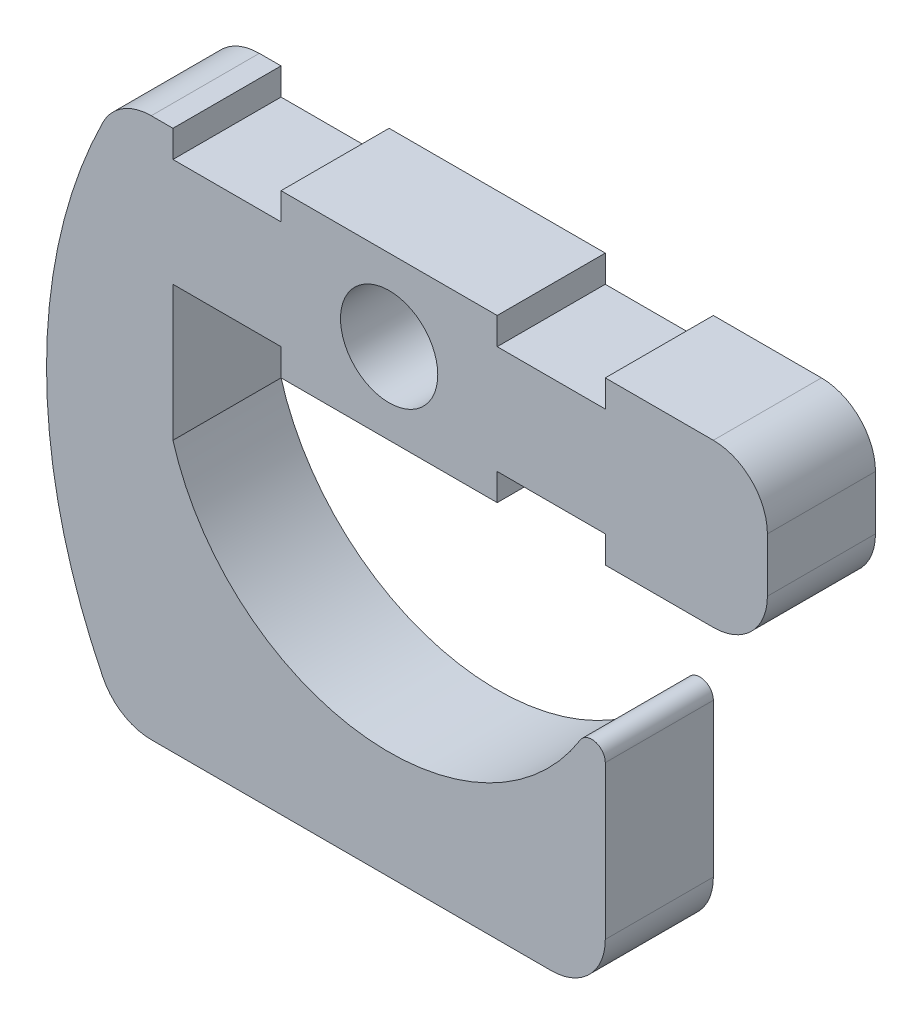
ISO-10303-21;
HEADER;
FILE_DESCRIPTION(('STEP AP214'),'2;1');
FILE_NAME('part.step','',(''),(''),'','','');
FILE_SCHEMA(('AUTOMOTIVE_DESIGN { 1 0 10303 214 1 1 1 1 }'));
ENDSEC;
DATA;
#1=APPLICATION_CONTEXT('core data for automotive mechanical design processes');
#2=APPLICATION_PROTOCOL_DEFINITION('international standard','automotive_design',2000,#1);
#3=PRODUCT_CONTEXT('',#1,'mechanical');
#4=PRODUCT('Part','Part','',(#3));
#5=PRODUCT_RELATED_PRODUCT_CATEGORY('part','',(#4));
#6=PRODUCT_DEFINITION_FORMATION('','',#4);
#7=PRODUCT_DEFINITION_CONTEXT('part definition',#1,'design');
#8=PRODUCT_DEFINITION('design','',#6,#7);
#9=PRODUCT_DEFINITION_SHAPE('','',#8);
#10=(LENGTH_UNIT() NAMED_UNIT(*) SI_UNIT(.MILLI.,.METRE.));
#11=(NAMED_UNIT(*) PLANE_ANGLE_UNIT() SI_UNIT($,.RADIAN.));
#12=(NAMED_UNIT(*) SI_UNIT($,.STERADIAN.) SOLID_ANGLE_UNIT());
#13=UNCERTAINTY_MEASURE_WITH_UNIT(LENGTH_MEASURE(1.E-05),#10,'distance_accuracy_value','');
#14=(GEOMETRIC_REPRESENTATION_CONTEXT(3) GLOBAL_UNCERTAINTY_ASSIGNED_CONTEXT((#13)) GLOBAL_UNIT_ASSIGNED_CONTEXT((#10,
#11,#12)) REPRESENTATION_CONTEXT('',''));
#15=CARTESIAN_POINT('',(0.,0.,0.));
#16=DIRECTION('',(0.,0.,1.));
#17=DIRECTION('',(1.,0.,0.));
#18=AXIS2_PLACEMENT_3D('',#15,#16,#17);
#19=CARTESIAN_POINT('',(0.,-3.81,2.54));
#20=DIRECTION('',(0.,1.,0.));
#21=DIRECTION('',(0.,0.,1.));
#22=AXIS2_PLACEMENT_3D('',#19,#20,#21);
#23=PLANE('',#22);
#24=DIRECTION('',(0.,0.,1.));
#25=VECTOR('',#24,1.);
#26=CARTESIAN_POINT('',(5.08,-3.81,-2.54));
#27=LINE('',#26,#25);
#28=CARTESIAN_POINT('',(5.08,-3.81,-2.54));
#29=VERTEX_POINT('',#28);
#30=CARTESIAN_POINT('',(5.08,-3.81,2.54));
#31=VERTEX_POINT('',#30);
#32=EDGE_CURVE('E605',#29,#31,#27,.T.);
#33=ORIENTED_EDGE('',*,*,#32,.T.);
#34=DIRECTION('',(1.,0.,0.));
#35=VECTOR('',#34,1.);
#36=CARTESIAN_POINT('',(0.,-3.81,2.54));
#37=LINE('',#36,#35);
#38=CARTESIAN_POINT('',(-5.08,-3.81,2.54));
#39=VERTEX_POINT('',#38);
#40=EDGE_CURVE('E284',#39,#31,#37,.T.);
#41=ORIENTED_EDGE('',*,*,#40,.F.);
#42=DIRECTION('',(0.,0.,-1.));
#43=VECTOR('',#42,1.);
#44=CARTESIAN_POINT('',(-5.08,-3.81,2.54));
#45=LINE('',#44,#43);
#46=CARTESIAN_POINT('',(-5.08,-3.81,-2.54));
#47=VERTEX_POINT('',#46);
#48=EDGE_CURVE('E377',#39,#47,#45,.T.);
#49=ORIENTED_EDGE('',*,*,#48,.T.);
#50=DIRECTION('',(1.,0.,0.));
#51=VECTOR('',#50,1.);
#52=CARTESIAN_POINT('',(0.,-3.81,-2.54));
#53=LINE('',#52,#51);
#54=EDGE_CURVE('E309',#47,#29,#53,.T.);
#55=ORIENTED_EDGE('',*,*,#54,.T.);
#56=EDGE_LOOP('',(#33,#41,#49,#55));
#57=FACE_BOUND('',#56,.T.);
#58=ADVANCED_FACE('F68',(#57),#23,.F.);
#59=CARTESIAN_POINT('',(0.,3.81,2.54));
#60=DIRECTION('',(0.,1.,0.));
#61=DIRECTION('',(0.,0.,1.));
#62=AXIS2_PLACEMENT_3D('',#59,#60,#61);
#63=PLANE('',#62);
#64=DIRECTION('',(1.,0.,0.));
#65=VECTOR('',#64,1.);
#66=CARTESIAN_POINT('',(0.,3.81,-2.54));
#67=LINE('',#66,#65);
#68=CARTESIAN_POINT('',(10.16,3.81,-2.54));
#69=VERTEX_POINT('',#68);
#70=CARTESIAN_POINT('',(15.24,3.81,-2.54));
#71=VERTEX_POINT('',#70);
#72=EDGE_CURVE('E270',#69,#71,#67,.T.);
#73=ORIENTED_EDGE('',*,*,#72,.F.);
#74=DIRECTION('',(0.,0.,1.));
#75=VECTOR('',#74,1.);
#76=CARTESIAN_POINT('',(10.16,3.81,-2.54));
#77=LINE('',#76,#75);
#78=CARTESIAN_POINT('',(10.16,3.81,2.54));
#79=VERTEX_POINT('',#78);
#80=EDGE_CURVE('E253',#69,#79,#77,.T.);
#81=ORIENTED_EDGE('',*,*,#80,.T.);
#82=DIRECTION('',(1.,0.,0.));
#83=VECTOR('',#82,1.);
#84=CARTESIAN_POINT('',(0.,3.81,2.54));
#85=LINE('',#84,#83);
#86=CARTESIAN_POINT('',(15.24,3.81,2.54));
#87=VERTEX_POINT('',#86);
#88=EDGE_CURVE('E268',#79,#87,#85,.T.);
#89=ORIENTED_EDGE('',*,*,#88,.T.);
#90=DIRECTION('',(0.,0.,-1.));
#91=VECTOR('',#90,1.);
#92=CARTESIAN_POINT('',(15.24,3.81,-2.54));
#93=LINE('',#92,#91);
#94=EDGE_CURVE('E365',#87,#71,#93,.T.);
#95=ORIENTED_EDGE('',*,*,#94,.T.);
#96=EDGE_LOOP('',(#73,#81,#89,#95));
#97=FACE_BOUND('',#96,.T.);
#98=ADVANCED_FACE('F266',(#97),#63,.T.);
#99=DIRECTION('',(0.,0.,1.));
#100=VECTOR('',#99,1.);
#101=CARTESIAN_POINT('',(5.08,3.81,-2.54));
#102=LINE('',#101,#100);
#103=CARTESIAN_POINT('',(5.08,3.81,-2.54));
#104=VERTEX_POINT('',#103);
#105=CARTESIAN_POINT('',(5.08,3.81,2.54));
#106=VERTEX_POINT('',#105);
#107=EDGE_CURVE('E578',#104,#106,#102,.T.);
#108=ORIENTED_EDGE('',*,*,#107,.F.);
#109=CARTESIAN_POINT('',(-5.08,3.81,-2.54));
#110=VERTEX_POINT('',#109);
#111=EDGE_CURVE('E319',#110,#104,#67,.T.);
#112=ORIENTED_EDGE('',*,*,#111,.F.);
#113=DIRECTION('',(0.,0.,1.));
#114=VECTOR('',#113,1.);
#115=CARTESIAN_POINT('',(-5.08,3.81,-2.54));
#116=LINE('',#115,#114);
#117=CARTESIAN_POINT('',(-5.08,3.81,2.54));
#118=VERTEX_POINT('',#117);
#119=EDGE_CURVE('E306',#110,#118,#116,.T.);
#120=ORIENTED_EDGE('',*,*,#119,.T.);
#121=EDGE_CURVE('E279',#118,#106,#85,.T.);
#122=ORIENTED_EDGE('',*,*,#121,.T.);
#123=EDGE_LOOP('',(#108,#112,#120,#122));
#124=FACE_BOUND('',#123,.T.);
#125=ADVANCED_FACE('F481',(#124),#63,.T.);
#126=CARTESIAN_POINT('',(0.,0.,2.54));
#127=DIRECTION('',(0.,0.,1.));
#128=DIRECTION('',(1.,0.,0.));
#129=AXIS2_PLACEMENT_3D('',#126,#127,#128);
#130=PLANE('',#129);
#131=DIRECTION('',(0.,-1.,0.));
#132=VECTOR('',#131,1.);
#133=CARTESIAN_POINT('',(10.16,0.,2.54));
#134=LINE('',#133,#132);
#135=CARTESIAN_POINT('',(10.16,-11.8533333333333,2.54));
#136=VERTEX_POINT('',#135);
#137=CARTESIAN_POINT('',(10.16,-19.05,2.54));
#138=VERTEX_POINT('',#137);
#139=EDGE_CURVE('E328',#136,#138,#134,.T.);
#140=ORIENTED_EDGE('',*,*,#139,.F.);
#141=CARTESIAN_POINT('',(9.525,-11.8533333333333,2.54));
#142=DIRECTION('',(0.,0.,1.));
#143=DIRECTION('',(1.,0.,0.));
#144=AXIS2_PLACEMENT_3D('',#141,#142,#143);
#145=CIRCLE('',#144,0.635);
#146=CARTESIAN_POINT('',(8.98584905660377,-11.5178616352201,2.54));
#147=VERTEX_POINT('',#146);
#148=EDGE_CURVE('E12',#136,#147,#145,.T.);
#149=ORIENTED_EDGE('',*,*,#148,.T.);
#150=CARTESIAN_POINT('',(0.,-5.92666666666666,2.54));
#151=DIRECTION('',(0.,0.,1.));
#152=DIRECTION('',(1.,0.,0.));
#153=AXIS2_PLACEMENT_3D('',#150,#151,#152);
#154=CIRCLE('',#153,10.5833333333333);
#155=CARTESIAN_POINT('',(-10.16,-8.89,2.54));
#156=VERTEX_POINT('',#155);
#157=EDGE_CURVE('E388',#147,#156,#154,.F.);
#158=ORIENTED_EDGE('',*,*,#157,.T.);
#159=DIRECTION('',(0.,1.,0.));
#160=VECTOR('',#159,1.);
#161=CARTESIAN_POINT('',(-10.16,0.,2.54));
#162=LINE('',#161,#160);
#163=CARTESIAN_POINT('',(-10.16,-2.54,2.54));
#164=VERTEX_POINT('',#163);
#165=EDGE_CURVE('E611',#156,#164,#162,.T.);
#166=ORIENTED_EDGE('',*,*,#165,.T.);
#167=DIRECTION('',(-1.,0.,0.));
#168=VECTOR('',#167,1.);
#169=CARTESIAN_POINT('',(0.,-2.54,2.54));
#170=LINE('',#169,#168);
#171=CARTESIAN_POINT('',(-5.08,-2.54,2.54));
#172=VERTEX_POINT('',#171);
#173=EDGE_CURVE('E400',#172,#164,#170,.T.);
#174=ORIENTED_EDGE('',*,*,#173,.F.);
#175=DIRECTION('',(0.,1.,0.));
#176=VECTOR('',#175,1.);
#177=CARTESIAN_POINT('',(-5.08,0.,2.54));
#178=LINE('',#177,#176);
#179=EDGE_CURVE('E404',#39,#172,#178,.T.);
#180=ORIENTED_EDGE('',*,*,#179,.F.);
#181=ORIENTED_EDGE('',*,*,#40,.T.);
#182=DIRECTION('',(0.,1.,0.));
#183=VECTOR('',#182,1.);
#184=CARTESIAN_POINT('',(5.08,0.,2.54));
#185=LINE('',#184,#183);
#186=CARTESIAN_POINT('',(5.08,-2.54,2.54));
#187=VERTEX_POINT('',#186);
#188=EDGE_CURVE('E613',#31,#187,#185,.T.);
#189=ORIENTED_EDGE('',*,*,#188,.T.);
#190=DIRECTION('',(1.,0.,0.));
#191=VECTOR('',#190,1.);
#192=CARTESIAN_POINT('',(0.,-2.54,2.54));
#193=LINE('',#192,#191);
#194=CARTESIAN_POINT('',(10.16,-2.54,2.54));
#195=VERTEX_POINT('',#194);
#196=EDGE_CURVE('E271',#187,#195,#193,.T.);
#197=ORIENTED_EDGE('',*,*,#196,.T.);
#198=DIRECTION('',(0.,1.,0.));
#199=VECTOR('',#198,1.);
#200=CARTESIAN_POINT('',(10.16,0.,2.54));
#201=LINE('',#200,#199);
#202=CARTESIAN_POINT('',(10.16,-3.81,2.54));
#203=VERTEX_POINT('',#202);
#204=EDGE_CURVE('E448',#203,#195,#201,.T.);
#205=ORIENTED_EDGE('',*,*,#204,.F.);
#206=CARTESIAN_POINT('',(15.24,-3.81,2.54));
#207=VERTEX_POINT('',#206);
#208=EDGE_CURVE('E437',#203,#207,#37,.T.);
#209=ORIENTED_EDGE('',*,*,#208,.T.);
#210=CARTESIAN_POINT('',(15.24,-1.27,2.54));
#211=DIRECTION('',(0.,0.,1.));
#212=DIRECTION('',(1.,0.,0.));
#213=AXIS2_PLACEMENT_3D('',#210,#211,#212);
#214=CIRCLE('',#213,2.54);
#215=CARTESIAN_POINT('',(17.78,-1.27,2.54));
#216=VERTEX_POINT('',#215);
#217=EDGE_CURVE('E350',#207,#216,#214,.T.);
#218=ORIENTED_EDGE('',*,*,#217,.T.);
#219=DIRECTION('',(0.,1.,0.));
#220=VECTOR('',#219,1.);
#221=CARTESIAN_POINT('',(17.78,0.,2.54));
#222=LINE('',#221,#220);
#223=CARTESIAN_POINT('',(17.78,1.27,2.54));
#224=VERTEX_POINT('',#223);
#225=EDGE_CURVE('E280',#216,#224,#222,.T.);
#226=ORIENTED_EDGE('',*,*,#225,.T.);
#227=CARTESIAN_POINT('',(15.24,1.27,2.54));
#228=DIRECTION('',(0.,0.,1.));
#229=DIRECTION('',(1.,0.,0.));
#230=AXIS2_PLACEMENT_3D('',#227,#228,#229);
#231=CIRCLE('',#230,2.54);
#232=EDGE_CURVE('E277',#224,#87,#231,.T.);
#233=ORIENTED_EDGE('',*,*,#232,.T.);
#234=ORIENTED_EDGE('',*,*,#88,.F.);
#235=DIRECTION('',(0.,-1.,0.));
#236=VECTOR('',#235,1.);
#237=CARTESIAN_POINT('',(10.16,0.,2.54));
#238=LINE('',#237,#236);
#239=CARTESIAN_POINT('',(10.16,2.54,2.54));
#240=VERTEX_POINT('',#239);
#241=EDGE_CURVE('E250',#79,#240,#238,.T.);
#242=ORIENTED_EDGE('',*,*,#241,.T.);
#243=DIRECTION('',(1.,0.,0.));
#244=VECTOR('',#243,1.);
#245=CARTESIAN_POINT('',(0.,2.54,2.54));
#246=LINE('',#245,#244);
#247=CARTESIAN_POINT('',(5.08,2.54,2.54));
#248=VERTEX_POINT('',#247);
#249=EDGE_CURVE('E261',#248,#240,#246,.T.);
#250=ORIENTED_EDGE('',*,*,#249,.F.);
#251=DIRECTION('',(0.,-1.,0.));
#252=VECTOR('',#251,1.);
#253=CARTESIAN_POINT('',(5.08,0.,2.54));
#254=LINE('',#253,#252);
#255=EDGE_CURVE('E423',#106,#248,#254,.T.);
#256=ORIENTED_EDGE('',*,*,#255,.F.);
#257=ORIENTED_EDGE('',*,*,#121,.F.);
#258=DIRECTION('',(0.,-1.,0.));
#259=VECTOR('',#258,1.);
#260=CARTESIAN_POINT('',(-5.08,0.,2.54));
#261=LINE('',#260,#259);
#262=CARTESIAN_POINT('',(-5.08,2.54,2.54));
#263=VERTEX_POINT('',#262);
#264=EDGE_CURVE('E413',#118,#263,#261,.T.);
#265=ORIENTED_EDGE('',*,*,#264,.T.);
#266=DIRECTION('',(-1.,0.,0.));
#267=VECTOR('',#266,1.);
#268=CARTESIAN_POINT('',(0.,2.54,2.54));
#269=LINE('',#268,#267);
#270=CARTESIAN_POINT('',(-10.16,2.54,2.54));
#271=VERTEX_POINT('',#270);
#272=EDGE_CURVE('E422',#263,#271,#269,.T.);
#273=ORIENTED_EDGE('',*,*,#272,.T.);
#274=DIRECTION('',(0.,-1.,0.));
#275=VECTOR('',#274,1.);
#276=CARTESIAN_POINT('',(-10.16,0.,2.54));
#277=LINE('',#276,#275);
#278=CARTESIAN_POINT('',(-10.16,3.81,2.54));
#279=VERTEX_POINT('',#278);
#280=EDGE_CURVE('E419',#279,#271,#277,.T.);
#281=ORIENTED_EDGE('',*,*,#280,.F.);
#282=CARTESIAN_POINT('',(-11.1810894245536,3.81,2.54));
#283=VERTEX_POINT('',#282);
#284=EDGE_CURVE('E282',#283,#279,#85,.T.);
#285=ORIENTED_EDGE('',*,*,#284,.F.);
#286=CARTESIAN_POINT('',(-11.1810894245536,1.27,2.54));
#287=DIRECTION('',(0.,0.,1.));
#288=DIRECTION('',(1.,0.,0.));
#289=AXIS2_PLACEMENT_3D('',#286,#287,#288);
#290=CIRCLE('',#289,2.54);
#291=CARTESIAN_POINT('',(-13.4564377224067,2.39888888888889,2.54));
#292=VERTEX_POINT('',#291);
#293=EDGE_CURVE('E353',#283,#292,#290,.T.);
#294=ORIENTED_EDGE('',*,*,#293,.T.);
#295=CARTESIAN_POINT('',(9.29704525612474,-8.89,2.54));
#296=DIRECTION('',(0.,0.,1.));
#297=DIRECTION('',(1.,0.,0.));
#298=AXIS2_PLACEMENT_3D('',#295,#296,#297);
#299=CIRCLE('',#298,25.4);
#300=CARTESIAN_POINT('',(-13.4564377224067,-20.1788888888889,2.54));
#301=VERTEX_POINT('',#300);
#302=EDGE_CURVE('E288',#292,#301,#299,.T.);
#303=ORIENTED_EDGE('',*,*,#302,.T.);
#304=CARTESIAN_POINT('',(-11.1810894245536,-19.05,2.54));
#305=DIRECTION('',(0.,0.,1.));
#306=DIRECTION('',(1.,0.,0.));
#307=AXIS2_PLACEMENT_3D('',#304,#305,#306);
#308=CIRCLE('',#307,2.54);
#309=CARTESIAN_POINT('',(-11.1810894245536,-21.59,2.54));
#310=VERTEX_POINT('',#309);
#311=EDGE_CURVE('E355',#301,#310,#308,.T.);
#312=ORIENTED_EDGE('',*,*,#311,.T.);
#313=DIRECTION('',(1.,0.,0.));
#314=VECTOR('',#313,1.);
#315=CARTESIAN_POINT('',(0.,-21.59,2.54));
#316=LINE('',#315,#314);
#317=CARTESIAN_POINT('',(7.62,-21.59,2.54));
#318=VERTEX_POINT('',#317);
#319=EDGE_CURVE('E293',#310,#318,#316,.T.);
#320=ORIENTED_EDGE('',*,*,#319,.T.);
#321=CARTESIAN_POINT('',(7.62,-19.05,2.54));
#322=DIRECTION('',(0.,0.,1.));
#323=DIRECTION('',(1.,0.,0.));
#324=AXIS2_PLACEMENT_3D('',#321,#322,#323);
#325=CIRCLE('',#324,2.54);
#326=EDGE_CURVE('E357',#318,#138,#325,.T.);
#327=ORIENTED_EDGE('',*,*,#326,.T.);
#328=EDGE_LOOP('',(#140,#149,#158,#166,#174,#180,#181,#189,#197,#205,#209,#218,#226,#233,#234,
#242,#250,#256,#257,#265,#273,#281,#285,#294,#303,#312,#320,#327));
#329=FACE_BOUND('',#328,.T.);
#330=CARTESIAN_POINT('',(0.,0.,2.54));
#331=DIRECTION('',(0.,0.,1.));
#332=DIRECTION('',(1.,0.,0.));
#333=AXIS2_PLACEMENT_3D('',#330,#331,#332);
#334=CIRCLE('',#333,2.286);
#335=CARTESIAN_POINT('',(2.28599999999999,0.,2.54));
#336=VERTEX_POINT('',#335);
#337=EDGE_CURVE('E297',#336,#336,#334,.T.);
#338=ORIENTED_EDGE('',*,*,#337,.F.);
#339=EDGE_LOOP('',(#338));
#340=FACE_BOUND('',#339,.T.);
#341=ADVANCED_FACE('F273',(#329,#340),#130,.T.);
#342=CARTESIAN_POINT('',(0.,0.,-2.54));
#343=DIRECTION('',(0.,0.,1.));
#344=DIRECTION('',(1.,0.,0.));
#345=AXIS2_PLACEMENT_3D('',#342,#343,#344);
#346=PLANE('',#345);
#347=CARTESIAN_POINT('',(0.,0.,-2.54));
#348=DIRECTION('',(0.,0.,1.));
#349=DIRECTION('',(1.,0.,0.));
#350=AXIS2_PLACEMENT_3D('',#347,#348,#349);
#351=CIRCLE('',#350,2.286);
#352=CARTESIAN_POINT('',(2.28599999999999,0.,-2.54));
#353=VERTEX_POINT('',#352);
#354=EDGE_CURVE('E325',#353,#353,#351,.T.);
#355=ORIENTED_EDGE('',*,*,#354,.T.);
#356=EDGE_LOOP('',(#355));
#357=FACE_BOUND('',#356,.T.);
#358=CARTESIAN_POINT('',(0.,-5.92666666666666,-2.54));
#359=DIRECTION('',(0.,0.,1.));
#360=DIRECTION('',(1.,0.,0.));
#361=AXIS2_PLACEMENT_3D('',#358,#359,#360);
#362=CIRCLE('',#361,10.5833333333333);
#363=CARTESIAN_POINT('',(8.98584905660377,-11.5178616352201,-2.54));
#364=VERTEX_POINT('',#363);
#365=CARTESIAN_POINT('',(-10.16,-8.89,-2.54));
#366=VERTEX_POINT('',#365);
#367=EDGE_CURVE('E305',#364,#366,#362,.F.);
#368=ORIENTED_EDGE('',*,*,#367,.F.);
#369=CARTESIAN_POINT('',(9.525,-11.8533333333333,-2.54));
#370=DIRECTION('',(0.,0.,1.));
#371=DIRECTION('',(1.,0.,0.));
#372=AXIS2_PLACEMENT_3D('',#369,#370,#371);
#373=CIRCLE('',#372,0.635);
#374=CARTESIAN_POINT('',(10.16,-11.8533333333333,-2.54));
#375=VERTEX_POINT('',#374);
#376=EDGE_CURVE('E90',#364,#375,#373,.F.);
#377=ORIENTED_EDGE('',*,*,#376,.T.);
#378=DIRECTION('',(0.,-1.,0.));
#379=VECTOR('',#378,1.);
#380=CARTESIAN_POINT('',(10.16,0.,-2.54));
#381=LINE('',#380,#379);
#382=CARTESIAN_POINT('',(10.16,-19.05,-2.54));
#383=VERTEX_POINT('',#382);
#384=EDGE_CURVE('E303',#375,#383,#381,.T.);
#385=ORIENTED_EDGE('',*,*,#384,.T.);
#386=CARTESIAN_POINT('',(7.62,-19.05,-2.54));
#387=DIRECTION('',(0.,0.,1.));
#388=DIRECTION('',(1.,0.,0.));
#389=AXIS2_PLACEMENT_3D('',#386,#387,#388);
#390=CIRCLE('',#389,2.54);
#391=CARTESIAN_POINT('',(7.62,-21.59,-2.54));
#392=VERTEX_POINT('',#391);
#393=EDGE_CURVE('E343',#383,#392,#390,.F.);
#394=ORIENTED_EDGE('',*,*,#393,.T.);
#395=DIRECTION('',(1.,0.,0.));
#396=VECTOR('',#395,1.);
#397=CARTESIAN_POINT('',(0.,-21.59,-2.54));
#398=LINE('',#397,#396);
#399=CARTESIAN_POINT('',(-11.1810894245536,-21.59,-2.54));
#400=VERTEX_POINT('',#399);
#401=EDGE_CURVE('E322',#400,#392,#398,.T.);
#402=ORIENTED_EDGE('',*,*,#401,.F.);
#403=CARTESIAN_POINT('',(-11.1810894245536,-19.05,-2.54));
#404=DIRECTION('',(0.,0.,1.));
#405=DIRECTION('',(1.,0.,0.));
#406=AXIS2_PLACEMENT_3D('',#403,#404,#405);
#407=CIRCLE('',#406,2.54);
#408=CARTESIAN_POINT('',(-13.4564377224067,-20.1788888888889,-2.54));
#409=VERTEX_POINT('',#408);
#410=EDGE_CURVE('E341',#400,#409,#407,.F.);
#411=ORIENTED_EDGE('',*,*,#410,.T.);
#412=CARTESIAN_POINT('',(9.29704525612474,-8.89,-2.54));
#413=DIRECTION('',(0.,0.,1.));
#414=DIRECTION('',(1.,0.,0.));
#415=AXIS2_PLACEMENT_3D('',#412,#413,#414);
#416=CIRCLE('',#415,25.4);
#417=CARTESIAN_POINT('',(-13.4564377224067,2.39888888888889,-2.54));
#418=VERTEX_POINT('',#417);
#419=EDGE_CURVE('E318',#418,#409,#416,.T.);
#420=ORIENTED_EDGE('',*,*,#419,.F.);
#421=CARTESIAN_POINT('',(-11.1810894245536,1.27,-2.54));
#422=DIRECTION('',(0.,0.,1.));
#423=DIRECTION('',(1.,0.,0.));
#424=AXIS2_PLACEMENT_3D('',#421,#422,#423);
#425=CIRCLE('',#424,2.54);
#426=CARTESIAN_POINT('',(-11.1810894245536,3.81,-2.54));
#427=VERTEX_POINT('',#426);
#428=EDGE_CURVE('E339',#418,#427,#425,.F.);
#429=ORIENTED_EDGE('',*,*,#428,.T.);
#430=CARTESIAN_POINT('',(-10.16,3.81,-2.54));
#431=VERTEX_POINT('',#430);
#432=EDGE_CURVE('E315',#427,#431,#67,.T.);
#433=ORIENTED_EDGE('',*,*,#432,.T.);
#434=DIRECTION('',(0.,-1.,0.));
#435=VECTOR('',#434,1.);
#436=CARTESIAN_POINT('',(-10.16,0.,-2.54));
#437=LINE('',#436,#435);
#438=CARTESIAN_POINT('',(-10.16,2.54,-2.54));
#439=VERTEX_POINT('',#438);
#440=EDGE_CURVE('E409',#431,#439,#437,.T.);
#441=ORIENTED_EDGE('',*,*,#440,.T.);
#442=DIRECTION('',(-1.,0.,0.));
#443=VECTOR('',#442,1.);
#444=CARTESIAN_POINT('',(0.,2.54,-2.54));
#445=LINE('',#444,#443);
#446=CARTESIAN_POINT('',(-5.08,2.54,-2.54));
#447=VERTEX_POINT('',#446);
#448=EDGE_CURVE('E412',#447,#439,#445,.T.);
#449=ORIENTED_EDGE('',*,*,#448,.F.);
#450=DIRECTION('',(0.,-1.,0.));
#451=VECTOR('',#450,1.);
#452=CARTESIAN_POINT('',(-5.08,0.,-2.54));
#453=LINE('',#452,#451);
#454=EDGE_CURVE('E416',#110,#447,#453,.T.);
#455=ORIENTED_EDGE('',*,*,#454,.F.);
#456=ORIENTED_EDGE('',*,*,#111,.T.);
#457=DIRECTION('',(0.,-1.,0.));
#458=VECTOR('',#457,1.);
#459=CARTESIAN_POINT('',(5.08,0.,-2.54));
#460=LINE('',#459,#458);
#461=CARTESIAN_POINT('',(5.08,2.54,-2.54));
#462=VERTEX_POINT('',#461);
#463=EDGE_CURVE('E262',#104,#462,#460,.T.);
#464=ORIENTED_EDGE('',*,*,#463,.T.);
#465=DIRECTION('',(1.,0.,0.));
#466=VECTOR('',#465,1.);
#467=CARTESIAN_POINT('',(0.,2.54,-2.54));
#468=LINE('',#467,#466);
#469=CARTESIAN_POINT('',(10.16,2.54,-2.54));
#470=VERTEX_POINT('',#469);
#471=EDGE_CURVE('E599',#462,#470,#468,.T.);
#472=ORIENTED_EDGE('',*,*,#471,.T.);
#473=DIRECTION('',(0.,-1.,0.));
#474=VECTOR('',#473,1.);
#475=CARTESIAN_POINT('',(10.16,0.,-2.54));
#476=LINE('',#475,#474);
#477=EDGE_CURVE('E584',#69,#470,#476,.T.);
#478=ORIENTED_EDGE('',*,*,#477,.F.);
#479=ORIENTED_EDGE('',*,*,#72,.T.);
#480=CARTESIAN_POINT('',(15.24,1.27,-2.54));
#481=DIRECTION('',(0.,0.,1.));
#482=DIRECTION('',(1.,0.,0.));
#483=AXIS2_PLACEMENT_3D('',#480,#481,#482);
#484=CIRCLE('',#483,2.54);
#485=CARTESIAN_POINT('',(17.78,1.27,-2.54));
#486=VERTEX_POINT('',#485);
#487=EDGE_CURVE('E337',#71,#486,#484,.F.);
#488=ORIENTED_EDGE('',*,*,#487,.T.);
#489=DIRECTION('',(0.,1.,0.));
#490=VECTOR('',#489,1.);
#491=CARTESIAN_POINT('',(17.78,0.,-2.54));
#492=LINE('',#491,#490);
#493=CARTESIAN_POINT('',(17.78,-1.27,-2.54));
#494=VERTEX_POINT('',#493);
#495=EDGE_CURVE('E312',#494,#486,#492,.T.);
#496=ORIENTED_EDGE('',*,*,#495,.F.);
#497=CARTESIAN_POINT('',(15.24,-1.27,-2.54));
#498=DIRECTION('',(0.,0.,1.));
#499=DIRECTION('',(1.,0.,0.));
#500=AXIS2_PLACEMENT_3D('',#497,#498,#499);
#501=CIRCLE('',#500,2.54);
#502=CARTESIAN_POINT('',(15.24,-3.81,-2.54));
#503=VERTEX_POINT('',#502);
#504=EDGE_CURVE('E334',#494,#503,#501,.F.);
#505=ORIENTED_EDGE('',*,*,#504,.T.);
#506=CARTESIAN_POINT('',(10.16,-3.81,-2.54));
#507=VERTEX_POINT('',#506);
#508=EDGE_CURVE('E308',#507,#503,#53,.T.);
#509=ORIENTED_EDGE('',*,*,#508,.F.);
#510=DIRECTION('',(0.,1.,0.));
#511=VECTOR('',#510,1.);
#512=CARTESIAN_POINT('',(10.16,0.,-2.54));
#513=LINE('',#512,#511);
#514=CARTESIAN_POINT('',(10.16,-2.54,-2.54));
#515=VERTEX_POINT('',#514);
#516=EDGE_CURVE('E604',#507,#515,#513,.T.);
#517=ORIENTED_EDGE('',*,*,#516,.T.);
#518=DIRECTION('',(1.,0.,0.));
#519=VECTOR('',#518,1.);
#520=CARTESIAN_POINT('',(0.,-2.54,-2.54));
#521=LINE('',#520,#519);
#522=CARTESIAN_POINT('',(5.08,-2.54,-2.54));
#523=VERTEX_POINT('',#522);
#524=EDGE_CURVE('E614',#523,#515,#521,.T.);
#525=ORIENTED_EDGE('',*,*,#524,.F.);
#526=DIRECTION('',(0.,1.,0.));
#527=VECTOR('',#526,1.);
#528=CARTESIAN_POINT('',(5.08,0.,-2.54));
#529=LINE('',#528,#527);
#530=EDGE_CURVE('E619',#29,#523,#529,.T.);
#531=ORIENTED_EDGE('',*,*,#530,.F.);
#532=ORIENTED_EDGE('',*,*,#54,.F.);
#533=DIRECTION('',(0.,1.,0.));
#534=VECTOR('',#533,1.);
#535=CARTESIAN_POINT('',(-5.08,0.,-2.54));
#536=LINE('',#535,#534);
#537=CARTESIAN_POINT('',(-5.08,-2.54,-2.54));
#538=VERTEX_POINT('',#537);
#539=EDGE_CURVE('E401',#47,#538,#536,.T.);
#540=ORIENTED_EDGE('',*,*,#539,.T.);
#541=DIRECTION('',(-1.,0.,0.));
#542=VECTOR('',#541,1.);
#543=CARTESIAN_POINT('',(0.,-2.54,-2.54));
#544=LINE('',#543,#542);
#545=CARTESIAN_POINT('',(-10.16,-2.54,-2.54));
#546=VERTEX_POINT('',#545);
#547=EDGE_CURVE('E397',#538,#546,#544,.T.);
#548=ORIENTED_EDGE('',*,*,#547,.T.);
#549=DIRECTION('',(0.,1.,0.));
#550=VECTOR('',#549,1.);
#551=CARTESIAN_POINT('',(-10.16,0.,-2.54));
#552=LINE('',#551,#550);
#553=EDGE_CURVE('E394',#366,#546,#552,.T.);
#554=ORIENTED_EDGE('',*,*,#553,.F.);
#555=EDGE_LOOP('',(#368,#377,#385,#394,#402,#411,#420,#429,#433,#441,#449,#455,#456,#464,#472,
#478,#479,#488,#496,#505,#509,#517,#525,#531,#532,#540,#548,#554));
#556=FACE_BOUND('',#555,.T.);
#557=ADVANCED_FACE('F392',(#357,#556),#346,.F.);
#558=CARTESIAN_POINT('',(10.16,0.,2.54));
#559=DIRECTION('',(1.,0.,0.));
#560=DIRECTION('',(0.,0.,-1.));
#561=AXIS2_PLACEMENT_3D('',#558,#559,#560);
#562=PLANE('',#561);
#563=ORIENTED_EDGE('',*,*,#384,.F.);
#564=DIRECTION('',(0.,0.,1.));
#565=VECTOR('',#564,1.);
#566=CARTESIAN_POINT('',(10.16,-11.8533333333333,2.54));
#567=LINE('',#566,#565);
#568=EDGE_CURVE('E76',#375,#136,#567,.T.);
#569=ORIENTED_EDGE('',*,*,#568,.T.);
#570=ORIENTED_EDGE('',*,*,#139,.T.);
#571=DIRECTION('',(0.,0.,-1.));
#572=VECTOR('',#571,1.);
#573=CARTESIAN_POINT('',(10.16,-19.05,-2.54));
#574=LINE('',#573,#572);
#575=EDGE_CURVE('E331',#138,#383,#574,.T.);
#576=ORIENTED_EDGE('',*,*,#575,.T.);
#577=EDGE_LOOP('',(#563,#569,#570,#576));
#578=FACE_BOUND('',#577,.T.);
#579=ADVANCED_FACE('F492',(#578),#562,.T.);
#580=CARTESIAN_POINT('',(0.,-5.92666666666666,2.54));
#581=DIRECTION('',(0.,0.,-1.));
#582=DIRECTION('',(-1.,0.,0.));
#583=AXIS2_PLACEMENT_3D('',#580,#581,#582);
#584=CYLINDRICAL_SURFACE('',#583,10.5833333333333);
#585=ORIENTED_EDGE('',*,*,#157,.F.);
#586=DIRECTION('',(0.,0.,-1.));
#587=VECTOR('',#586,1.);
#588=CARTESIAN_POINT('',(8.98584905660377,-11.5178616352201,2.54));
#589=LINE('',#588,#587);
#590=EDGE_CURVE('E380',#147,#364,#589,.T.);
#591=ORIENTED_EDGE('',*,*,#590,.T.);
#592=ORIENTED_EDGE('',*,*,#367,.T.);
#593=DIRECTION('',(0.,0.,-1.));
#594=VECTOR('',#593,1.);
#595=CARTESIAN_POINT('',(-10.16,-8.89,2.54));
#596=LINE('',#595,#594);
#597=EDGE_CURVE('E302',#156,#366,#596,.T.);
#598=ORIENTED_EDGE('',*,*,#597,.F.);
#599=EDGE_LOOP('',(#585,#591,#592,#598));
#600=FACE_BOUND('',#599,.T.);
#601=ADVANCED_FACE('F386',(#600),#584,.F.);
#602=ORIENTED_EDGE('',*,*,#208,.F.);
#603=DIRECTION('',(0.,0.,1.));
#604=VECTOR('',#603,1.);
#605=CARTESIAN_POINT('',(10.16,-3.81,-2.54));
#606=LINE('',#605,#604);
#607=EDGE_CURVE('E607',#507,#203,#606,.T.);
#608=ORIENTED_EDGE('',*,*,#607,.F.);
#609=ORIENTED_EDGE('',*,*,#508,.T.);
#610=DIRECTION('',(0.,0.,-1.));
#611=VECTOR('',#610,1.);
#612=CARTESIAN_POINT('',(15.24,-3.81,2.54));
#613=LINE('',#612,#611);
#614=EDGE_CURVE('E374',#503,#207,#613,.F.);
#615=ORIENTED_EDGE('',*,*,#614,.T.);
#616=EDGE_LOOP('',(#602,#608,#609,#615));
#617=FACE_BOUND('',#616,.T.);
#618=ADVANCED_FACE('F452',(#617),#23,.F.);
#619=CARTESIAN_POINT('',(17.78,0.,2.54));
#620=DIRECTION('',(-1.,0.,0.));
#621=DIRECTION('',(0.,0.,1.));
#622=AXIS2_PLACEMENT_3D('',#619,#620,#621);
#623=PLANE('',#622);
#624=ORIENTED_EDGE('',*,*,#495,.T.);
#625=DIRECTION('',(0.,0.,-1.));
#626=VECTOR('',#625,1.);
#627=CARTESIAN_POINT('',(17.78,1.27,2.54));
#628=LINE('',#627,#626);
#629=EDGE_CURVE('E372',#486,#224,#628,.F.);
#630=ORIENTED_EDGE('',*,*,#629,.T.);
#631=ORIENTED_EDGE('',*,*,#225,.F.);
#632=DIRECTION('',(0.,0.,-1.));
#633=VECTOR('',#632,1.);
#634=CARTESIAN_POINT('',(17.78,-1.27,2.54));
#635=LINE('',#634,#633);
#636=EDGE_CURVE('E369',#216,#494,#635,.T.);
#637=ORIENTED_EDGE('',*,*,#636,.T.);
#638=EDGE_LOOP('',(#624,#630,#631,#637));
#639=FACE_BOUND('',#638,.T.);
#640=ADVANCED_FACE('F459',(#639),#623,.F.);
#641=DIRECTION('',(0.,0.,1.));
#642=VECTOR('',#641,1.);
#643=CARTESIAN_POINT('',(-10.16,3.81,-2.54));
#644=LINE('',#643,#642);
#645=EDGE_CURVE('E418',#431,#279,#644,.T.);
#646=ORIENTED_EDGE('',*,*,#645,.F.);
#647=ORIENTED_EDGE('',*,*,#432,.F.);
#648=DIRECTION('',(0.,0.,1.));
#649=VECTOR('',#648,1.);
#650=CARTESIAN_POINT('',(-11.1810894245536,3.81,2.54));
#651=LINE('',#650,#649);
#652=EDGE_CURVE('E367',#427,#283,#651,.T.);
#653=ORIENTED_EDGE('',*,*,#652,.T.);
#654=ORIENTED_EDGE('',*,*,#284,.T.);
#655=EDGE_LOOP('',(#646,#647,#653,#654));
#656=FACE_BOUND('',#655,.T.);
#657=ADVANCED_FACE('F483',(#656),#63,.T.);
#658=CARTESIAN_POINT('',(9.29704525612474,-8.89,2.54));
#659=DIRECTION('',(0.,0.,-1.));
#660=DIRECTION('',(-1.,0.,0.));
#661=AXIS2_PLACEMENT_3D('',#658,#659,#660);
#662=CYLINDRICAL_SURFACE('',#661,25.4);
#663=ORIENTED_EDGE('',*,*,#419,.T.);
#664=DIRECTION('',(0.,0.,-1.));
#665=VECTOR('',#664,1.);
#666=CARTESIAN_POINT('',(-13.4564377224067,-20.1788888888889,2.54));
#667=LINE('',#666,#665);
#668=EDGE_CURVE('E363',#409,#301,#667,.F.);
#669=ORIENTED_EDGE('',*,*,#668,.T.);
#670=ORIENTED_EDGE('',*,*,#302,.F.);
#671=DIRECTION('',(0.,0.,-1.));
#672=VECTOR('',#671,1.);
#673=CARTESIAN_POINT('',(-13.4564377224067,2.39888888888889,2.54));
#674=LINE('',#673,#672);
#675=EDGE_CURVE('E360',#292,#418,#674,.T.);
#676=ORIENTED_EDGE('',*,*,#675,.T.);
#677=EDGE_LOOP('',(#663,#669,#670,#676));
#678=FACE_BOUND('',#677,.T.);
#679=ADVANCED_FACE('F566',(#678),#662,.T.);
#680=CARTESIAN_POINT('',(0.,-21.59,2.54));
#681=DIRECTION('',(0.,1.,0.));
#682=DIRECTION('',(0.,0.,1.));
#683=AXIS2_PLACEMENT_3D('',#680,#681,#682);
#684=PLANE('',#683);
#685=ORIENTED_EDGE('',*,*,#401,.T.);
#686=DIRECTION('',(0.,0.,-1.));
#687=VECTOR('',#686,1.);
#688=CARTESIAN_POINT('',(7.62,-21.59,2.54));
#689=LINE('',#688,#687);
#690=EDGE_CURVE('E348',#392,#318,#689,.F.);
#691=ORIENTED_EDGE('',*,*,#690,.T.);
#692=ORIENTED_EDGE('',*,*,#319,.F.);
#693=DIRECTION('',(0.,0.,-1.));
#694=VECTOR('',#693,1.);
#695=CARTESIAN_POINT('',(-11.1810894245536,-21.59,2.54));
#696=LINE('',#695,#694);
#697=EDGE_CURVE('E345',#310,#400,#696,.T.);
#698=ORIENTED_EDGE('',*,*,#697,.T.);
#699=EDGE_LOOP('',(#685,#691,#692,#698));
#700=FACE_BOUND('',#699,.T.);
#701=ADVANCED_FACE('F512',(#700),#684,.F.);
#702=CARTESIAN_POINT('',(0.,0.,2.54));
#703=DIRECTION('',(0.,0.,-1.));
#704=DIRECTION('',(-1.,0.,0.));
#705=AXIS2_PLACEMENT_3D('',#702,#703,#704);
#706=CYLINDRICAL_SURFACE('',#705,2.286);
#707=ORIENTED_EDGE('',*,*,#337,.T.);
#708=EDGE_LOOP('',(#707));
#709=FACE_BOUND('',#708,.T.);
#710=ORIENTED_EDGE('',*,*,#354,.F.);
#711=EDGE_LOOP('',(#710));
#712=FACE_BOUND('',#711,.T.);
#713=ADVANCED_FACE('F501',(#709,#712),#706,.F.);
#714=CARTESIAN_POINT('',(7.62,-19.05,2.54));
#715=DIRECTION('',(0.,0.,1.));
#716=DIRECTION('',(1.,0.,0.));
#717=AXIS2_PLACEMENT_3D('',#714,#715,#716);
#718=CYLINDRICAL_SURFACE('',#717,2.54);
#719=ORIENTED_EDGE('',*,*,#326,.F.);
#720=ORIENTED_EDGE('',*,*,#690,.F.);
#721=ORIENTED_EDGE('',*,*,#393,.F.);
#722=ORIENTED_EDGE('',*,*,#575,.F.);
#723=EDGE_LOOP('',(#719,#720,#721,#722));
#724=FACE_BOUND('',#723,.T.);
#725=ADVANCED_FACE('F498',(#724),#718,.T.);
#726=CARTESIAN_POINT('',(-11.1810894245536,-19.05,2.54));
#727=DIRECTION('',(0.,0.,-1.));
#728=DIRECTION('',(-1.,0.,0.));
#729=AXIS2_PLACEMENT_3D('',#726,#727,#728);
#730=CYLINDRICAL_SURFACE('',#729,2.54);
#731=ORIENTED_EDGE('',*,*,#311,.F.);
#732=ORIENTED_EDGE('',*,*,#668,.F.);
#733=ORIENTED_EDGE('',*,*,#410,.F.);
#734=ORIENTED_EDGE('',*,*,#697,.F.);
#735=EDGE_LOOP('',(#731,#732,#733,#734));
#736=FACE_BOUND('',#735,.T.);
#737=ADVANCED_FACE('F472',(#736),#730,.T.);
#738=CARTESIAN_POINT('',(-11.1810894245536,1.27,2.54));
#739=DIRECTION('',(0.,0.,-1.));
#740=DIRECTION('',(-1.,0.,0.));
#741=AXIS2_PLACEMENT_3D('',#738,#739,#740);
#742=CYLINDRICAL_SURFACE('',#741,2.54);
#743=ORIENTED_EDGE('',*,*,#293,.F.);
#744=ORIENTED_EDGE('',*,*,#652,.F.);
#745=ORIENTED_EDGE('',*,*,#428,.F.);
#746=ORIENTED_EDGE('',*,*,#675,.F.);
#747=EDGE_LOOP('',(#743,#744,#745,#746));
#748=FACE_BOUND('',#747,.T.);
#749=ADVANCED_FACE('F465',(#748),#742,.T.);
#750=CARTESIAN_POINT('',(15.24,1.27,2.54));
#751=DIRECTION('',(0.,0.,1.));
#752=DIRECTION('',(1.,0.,0.));
#753=AXIS2_PLACEMENT_3D('',#750,#751,#752);
#754=CYLINDRICAL_SURFACE('',#753,2.54);
#755=ORIENTED_EDGE('',*,*,#232,.F.);
#756=ORIENTED_EDGE('',*,*,#629,.F.);
#757=ORIENTED_EDGE('',*,*,#487,.F.);
#758=ORIENTED_EDGE('',*,*,#94,.F.);
#759=EDGE_LOOP('',(#755,#756,#757,#758));
#760=FACE_BOUND('',#759,.T.);
#761=ADVANCED_FACE('F463',(#760),#754,.T.);
#762=CARTESIAN_POINT('',(15.24,-1.27,2.54));
#763=DIRECTION('',(0.,0.,-1.));
#764=DIRECTION('',(-1.,0.,0.));
#765=AXIS2_PLACEMENT_3D('',#762,#763,#764);
#766=CYLINDRICAL_SURFACE('',#765,2.54);
#767=ORIENTED_EDGE('',*,*,#217,.F.);
#768=ORIENTED_EDGE('',*,*,#614,.F.);
#769=ORIENTED_EDGE('',*,*,#504,.F.);
#770=ORIENTED_EDGE('',*,*,#636,.F.);
#771=EDGE_LOOP('',(#767,#768,#769,#770));
#772=FACE_BOUND('',#771,.T.);
#773=ADVANCED_FACE('F456',(#772),#766,.T.);
#774=CARTESIAN_POINT('',(-5.08,0.,-2.54));
#775=DIRECTION('',(1.,0.,0.));
#776=DIRECTION('',(0.,1.,0.));
#777=AXIS2_PLACEMENT_3D('',#774,#775,#776);
#778=PLANE('',#777);
#779=ORIENTED_EDGE('',*,*,#179,.T.);
#780=DIRECTION('',(0.,0.,1.));
#781=VECTOR('',#780,1.);
#782=CARTESIAN_POINT('',(-5.08,-2.54,-2.54));
#783=LINE('',#782,#781);
#784=EDGE_CURVE('E622',#538,#172,#783,.T.);
#785=ORIENTED_EDGE('',*,*,#784,.F.);
#786=ORIENTED_EDGE('',*,*,#539,.F.);
#787=ORIENTED_EDGE('',*,*,#48,.F.);
#788=EDGE_LOOP('',(#779,#785,#786,#787));
#789=FACE_BOUND('',#788,.T.);
#790=ADVANCED_FACE('F471',(#789),#778,.F.);
#791=CARTESIAN_POINT('',(0.,-2.54,-2.54));
#792=DIRECTION('',(0.,1.,0.));
#793=DIRECTION('',(-1.,0.,0.));
#794=AXIS2_PLACEMENT_3D('',#791,#792,#793);
#795=PLANE('',#794);
#796=ORIENTED_EDGE('',*,*,#173,.T.);
#797=DIRECTION('',(0.,0.,1.));
#798=VECTOR('',#797,1.);
#799=CARTESIAN_POINT('',(-10.16,-2.54,-2.54));
#800=LINE('',#799,#798);
#801=EDGE_CURVE('E624',#546,#164,#800,.T.);
#802=ORIENTED_EDGE('',*,*,#801,.F.);
#803=ORIENTED_EDGE('',*,*,#547,.F.);
#804=ORIENTED_EDGE('',*,*,#784,.T.);
#805=EDGE_LOOP('',(#796,#802,#803,#804));
#806=FACE_BOUND('',#805,.T.);
#807=ADVANCED_FACE('F538',(#806),#795,.F.);
#808=CARTESIAN_POINT('',(-10.16,0.,-2.54));
#809=DIRECTION('',(1.,0.,0.));
#810=DIRECTION('',(0.,0.,-1.));
#811=AXIS2_PLACEMENT_3D('',#808,#809,#810);
#812=PLANE('',#811);
#813=ORIENTED_EDGE('',*,*,#553,.T.);
#814=ORIENTED_EDGE('',*,*,#801,.T.);
#815=ORIENTED_EDGE('',*,*,#165,.F.);
#816=ORIENTED_EDGE('',*,*,#597,.T.);
#817=EDGE_LOOP('',(#813,#814,#815,#816));
#818=FACE_BOUND('',#817,.T.);
#819=ADVANCED_FACE('F534',(#818),#812,.T.);
#820=CARTESIAN_POINT('',(-5.08,0.,-2.54));
#821=DIRECTION('',(-1.,0.,0.));
#822=DIRECTION('',(0.,0.,1.));
#823=AXIS2_PLACEMENT_3D('',#820,#821,#822);
#824=PLANE('',#823);
#825=ORIENTED_EDGE('',*,*,#264,.F.);
#826=ORIENTED_EDGE('',*,*,#119,.F.);
#827=ORIENTED_EDGE('',*,*,#454,.T.);
#828=DIRECTION('',(0.,0.,1.));
#829=VECTOR('',#828,1.);
#830=CARTESIAN_POINT('',(-5.08,2.54,-2.54));
#831=LINE('',#830,#829);
#832=EDGE_CURVE('E430',#447,#263,#831,.T.);
#833=ORIENTED_EDGE('',*,*,#832,.T.);
#834=EDGE_LOOP('',(#825,#826,#827,#833));
#835=FACE_BOUND('',#834,.T.);
#836=ADVANCED_FACE('F537',(#835),#824,.T.);
#837=CARTESIAN_POINT('',(0.,2.54,-2.54));
#838=DIRECTION('',(0.,1.,0.));
#839=DIRECTION('',(-1.,0.,0.));
#840=AXIS2_PLACEMENT_3D('',#837,#838,#839);
#841=PLANE('',#840);
#842=ORIENTED_EDGE('',*,*,#272,.F.);
#843=ORIENTED_EDGE('',*,*,#832,.F.);
#844=ORIENTED_EDGE('',*,*,#448,.T.);
#845=DIRECTION('',(0.,0.,1.));
#846=VECTOR('',#845,1.);
#847=CARTESIAN_POINT('',(-10.16,2.54,-2.54));
#848=LINE('',#847,#846);
#849=EDGE_CURVE('E432',#439,#271,#848,.T.);
#850=ORIENTED_EDGE('',*,*,#849,.T.);
#851=EDGE_LOOP('',(#842,#843,#844,#850));
#852=FACE_BOUND('',#851,.T.);
#853=ADVANCED_FACE('F547',(#852),#841,.T.);
#854=CARTESIAN_POINT('',(-10.16,0.,-2.54));
#855=DIRECTION('',(-1.,0.,0.));
#856=DIRECTION('',(0.,0.,1.));
#857=AXIS2_PLACEMENT_3D('',#854,#855,#856);
#858=PLANE('',#857);
#859=ORIENTED_EDGE('',*,*,#280,.T.);
#860=ORIENTED_EDGE('',*,*,#849,.F.);
#861=ORIENTED_EDGE('',*,*,#440,.F.);
#862=ORIENTED_EDGE('',*,*,#645,.T.);
#863=EDGE_LOOP('',(#859,#860,#861,#862));
#864=FACE_BOUND('',#863,.T.);
#865=ADVANCED_FACE('F551',(#864),#858,.F.);
#866=CARTESIAN_POINT('',(10.16,0.,-2.54));
#867=DIRECTION('',(-1.,0.,0.));
#868=DIRECTION('',(0.,0.,1.));
#869=AXIS2_PLACEMENT_3D('',#866,#867,#868);
#870=PLANE('',#869);
#871=ORIENTED_EDGE('',*,*,#241,.F.);
#872=ORIENTED_EDGE('',*,*,#80,.F.);
#873=ORIENTED_EDGE('',*,*,#477,.T.);
#874=DIRECTION('',(0.,0.,1.));
#875=VECTOR('',#874,1.);
#876=CARTESIAN_POINT('',(10.16,2.54,-2.54));
#877=LINE('',#876,#875);
#878=EDGE_CURVE('E256',#470,#240,#877,.T.);
#879=ORIENTED_EDGE('',*,*,#878,.T.);
#880=EDGE_LOOP('',(#871,#872,#873,#879));
#881=FACE_BOUND('',#880,.T.);
#882=ADVANCED_FACE('F252',(#881),#870,.T.);
#883=CARTESIAN_POINT('',(0.,2.54,-2.54));
#884=DIRECTION('',(0.,-1.,0.));
#885=DIRECTION('',(1.,0.,0.));
#886=AXIS2_PLACEMENT_3D('',#883,#884,#885);
#887=PLANE('',#886);
#888=ORIENTED_EDGE('',*,*,#249,.T.);
#889=ORIENTED_EDGE('',*,*,#878,.F.);
#890=ORIENTED_EDGE('',*,*,#471,.F.);
#891=DIRECTION('',(0.,0.,1.));
#892=VECTOR('',#891,1.);
#893=CARTESIAN_POINT('',(5.08,2.54,-2.54));
#894=LINE('',#893,#892);
#895=EDGE_CURVE('E585',#462,#248,#894,.T.);
#896=ORIENTED_EDGE('',*,*,#895,.T.);
#897=EDGE_LOOP('',(#888,#889,#890,#896));
#898=FACE_BOUND('',#897,.T.);
#899=ADVANCED_FACE('F643',(#898),#887,.F.);
#900=CARTESIAN_POINT('',(5.08,0.,-2.54));
#901=DIRECTION('',(-1.,0.,0.));
#902=DIRECTION('',(0.,0.,1.));
#903=AXIS2_PLACEMENT_3D('',#900,#901,#902);
#904=PLANE('',#903);
#905=ORIENTED_EDGE('',*,*,#255,.T.);
#906=ORIENTED_EDGE('',*,*,#895,.F.);
#907=ORIENTED_EDGE('',*,*,#463,.F.);
#908=ORIENTED_EDGE('',*,*,#107,.T.);
#909=EDGE_LOOP('',(#905,#906,#907,#908));
#910=FACE_BOUND('',#909,.T.);
#911=ADVANCED_FACE('F639',(#910),#904,.F.);
#912=CARTESIAN_POINT('',(0.,-2.54,-2.54));
#913=DIRECTION('',(0.,-1.,0.));
#914=DIRECTION('',(1.,0.,0.));
#915=AXIS2_PLACEMENT_3D('',#912,#913,#914);
#916=PLANE('',#915);
#917=ORIENTED_EDGE('',*,*,#196,.F.);
#918=DIRECTION('',(0.,0.,1.));
#919=VECTOR('',#918,1.);
#920=CARTESIAN_POINT('',(5.08,-2.54,-2.54));
#921=LINE('',#920,#919);
#922=EDGE_CURVE('E602',#523,#187,#921,.T.);
#923=ORIENTED_EDGE('',*,*,#922,.F.);
#924=ORIENTED_EDGE('',*,*,#524,.T.);
#925=DIRECTION('',(0.,0.,1.));
#926=VECTOR('',#925,1.);
#927=CARTESIAN_POINT('',(10.16,-2.54,-2.54));
#928=LINE('',#927,#926);
#929=EDGE_CURVE('E609',#515,#195,#928,.T.);
#930=ORIENTED_EDGE('',*,*,#929,.T.);
#931=EDGE_LOOP('',(#917,#923,#924,#930));
#932=FACE_BOUND('',#931,.T.);
#933=ADVANCED_FACE('F528',(#932),#916,.T.);
#934=CARTESIAN_POINT('',(10.16,0.,-2.54));
#935=DIRECTION('',(1.,0.,0.));
#936=DIRECTION('',(0.,0.,-1.));
#937=AXIS2_PLACEMENT_3D('',#934,#935,#936);
#938=PLANE('',#937);
#939=ORIENTED_EDGE('',*,*,#204,.T.);
#940=ORIENTED_EDGE('',*,*,#929,.F.);
#941=ORIENTED_EDGE('',*,*,#516,.F.);
#942=ORIENTED_EDGE('',*,*,#607,.T.);
#943=EDGE_LOOP('',(#939,#940,#941,#942));
#944=FACE_BOUND('',#943,.T.);
#945=ADVANCED_FACE('F522',(#944),#938,.F.);
#946=CARTESIAN_POINT('',(5.08,0.,-2.54));
#947=DIRECTION('',(1.,0.,0.));
#948=DIRECTION('',(0.,1.,0.));
#949=AXIS2_PLACEMENT_3D('',#946,#947,#948);
#950=PLANE('',#949);
#951=ORIENTED_EDGE('',*,*,#188,.F.);
#952=ORIENTED_EDGE('',*,*,#32,.F.);
#953=ORIENTED_EDGE('',*,*,#530,.T.);
#954=ORIENTED_EDGE('',*,*,#922,.T.);
#955=EDGE_LOOP('',(#951,#952,#953,#954));
#956=FACE_BOUND('',#955,.T.);
#957=ADVANCED_FACE('F518',(#956),#950,.T.);
#958=CARTESIAN_POINT('',(9.525,-11.8533333333333,2.54));
#959=DIRECTION('',(0.,0.,-1.));
#960=DIRECTION('',(-1.,0.,0.));
#961=AXIS2_PLACEMENT_3D('',#958,#959,#960);
#962=CYLINDRICAL_SURFACE('',#961,0.635);
#963=ORIENTED_EDGE('',*,*,#148,.F.);
#964=ORIENTED_EDGE('',*,*,#568,.F.);
#965=ORIENTED_EDGE('',*,*,#376,.F.);
#966=ORIENTED_EDGE('',*,*,#590,.F.);
#967=EDGE_LOOP('',(#963,#964,#965,#966));
#968=FACE_BOUND('',#967,.T.);
#969=ADVANCED_FACE('F70',(#968),#962,.T.);
#970=CLOSED_SHELL('',(#58,#98,#125,#341,#557,#579,#601,#618,#640,#657,#679,#701,#713,#725,#737,
#749,#761,#773,#790,#807,#819,#836,#853,#865,#882,#899,#911,#933,#945,#957,#969));
#971=MANIFOLD_SOLID_BREP('B2',#970);
#972=ADVANCED_BREP_SHAPE_REPRESENTATION('',(#18,#971),#14);
#973=SHAPE_DEFINITION_REPRESENTATION(#9,#972);
ENDSEC;
END-ISO-10303-21;
